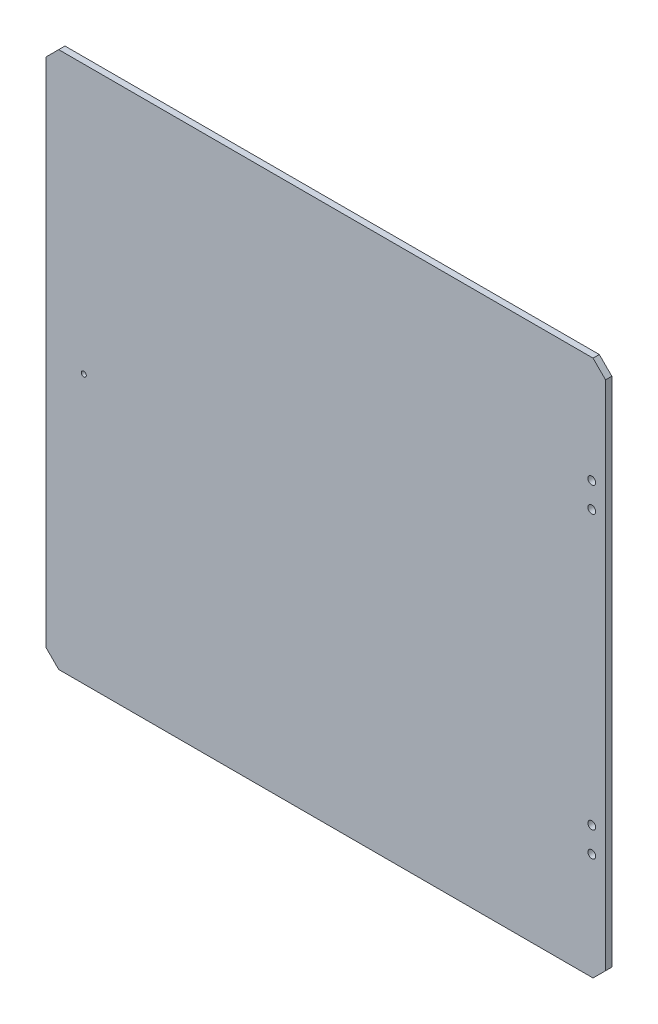
ISO-10303-21;
HEADER;
FILE_DESCRIPTION(('STEP AP214'),'2;1');
FILE_NAME('part.step','',(''),(''),'','','');
FILE_SCHEMA(('AUTOMOTIVE_DESIGN { 1 0 10303 214 1 1 1 1 }'));
ENDSEC;
DATA;
#1=APPLICATION_CONTEXT('core data for automotive mechanical design processes');
#2=APPLICATION_PROTOCOL_DEFINITION('international standard','automotive_design',2000,#1);
#3=PRODUCT_CONTEXT('',#1,'mechanical');
#4=PRODUCT('Part','Part','',(#3));
#5=PRODUCT_RELATED_PRODUCT_CATEGORY('part','',(#4));
#6=PRODUCT_DEFINITION_FORMATION('','',#4);
#7=PRODUCT_DEFINITION_CONTEXT('part definition',#1,'design');
#8=PRODUCT_DEFINITION('design','',#6,#7);
#9=PRODUCT_DEFINITION_SHAPE('','',#8);
#10=(LENGTH_UNIT() NAMED_UNIT(*) SI_UNIT(.MILLI.,.METRE.));
#11=(NAMED_UNIT(*) PLANE_ANGLE_UNIT() SI_UNIT($,.RADIAN.));
#12=(NAMED_UNIT(*) SI_UNIT($,.STERADIAN.) SOLID_ANGLE_UNIT());
#13=UNCERTAINTY_MEASURE_WITH_UNIT(LENGTH_MEASURE(1.E-05),#10,'distance_accuracy_value','');
#14=(GEOMETRIC_REPRESENTATION_CONTEXT(3) GLOBAL_UNCERTAINTY_ASSIGNED_CONTEXT((#13)) GLOBAL_UNIT_ASSIGNED_CONTEXT((#10,
#11,#12)) REPRESENTATION_CONTEXT('',''));
#15=CARTESIAN_POINT('',(0.,0.,0.));
#16=DIRECTION('',(0.,0.,1.));
#17=DIRECTION('',(1.,0.,0.));
#18=AXIS2_PLACEMENT_3D('',#15,#16,#17);
#19=CARTESIAN_POINT('',(0.,0.,5.));
#20=DIRECTION('',(0.,0.,1.));
#21=DIRECTION('',(1.,0.,0.));
#22=AXIS2_PLACEMENT_3D('',#19,#20,#21);
#23=PLANE('',#22);
#24=CARTESIAN_POINT('',(212.,-129.,5.));
#25=DIRECTION('',(0.,0.,1.));
#26=DIRECTION('',(-1.,0.,0.));
#27=AXIS2_PLACEMENT_3D('',#24,#25,#26);
#28=CIRCLE('',#27,3.09999999999999);
#29=CARTESIAN_POINT('',(208.9,-129.,5.));
#30=VERTEX_POINT('',#29);
#31=EDGE_CURVE('E208',#30,#30,#28,.T.);
#32=ORIENTED_EDGE('',*,*,#31,.F.);
#33=EDGE_LOOP('',(#32));
#34=FACE_BOUND('',#33,.T.);
#35=CARTESIAN_POINT('',(212.,109.,5.));
#36=DIRECTION('',(0.,0.,1.));
#37=DIRECTION('',(1.,0.,0.));
#38=AXIS2_PLACEMENT_3D('',#35,#36,#37);
#39=CIRCLE('',#38,3.09999999999999);
#40=CARTESIAN_POINT('',(215.1,109.,5.));
#41=VERTEX_POINT('',#40);
#42=EDGE_CURVE('E198',#41,#41,#39,.T.);
#43=ORIENTED_EDGE('',*,*,#42,.F.);
#44=EDGE_LOOP('',(#43));
#45=FACE_BOUND('',#44,.T.);
#46=DIRECTION('',(0.,-1.,0.));
#47=VECTOR('',#46,1.);
#48=CARTESIAN_POINT('',(-223.,-204.,5.));
#49=LINE('',#48,#47);
#50=CARTESIAN_POINT('',(-223.,204.,5.));
#51=VERTEX_POINT('',#50);
#52=CARTESIAN_POINT('',(-223.,-204.,5.));
#53=VERTEX_POINT('',#52);
#54=EDGE_CURVE('E172',#51,#53,#49,.T.);
#55=ORIENTED_EDGE('',*,*,#54,.T.);
#56=DIRECTION('',(0.707106781186548,-0.707106781186546,0.));
#57=VECTOR('',#56,1.);
#58=CARTESIAN_POINT('',(-213.,-214.,5.));
#59=LINE('',#58,#57);
#60=CARTESIAN_POINT('',(-213.,-214.,5.));
#61=VERTEX_POINT('',#60);
#62=EDGE_CURVE('E108',#53,#61,#59,.T.);
#63=ORIENTED_EDGE('',*,*,#62,.T.);
#64=DIRECTION('',(1.,0.,0.));
#65=VECTOR('',#64,1.);
#66=CARTESIAN_POINT('',(213.,-214.,5.));
#67=LINE('',#66,#65);
#68=CARTESIAN_POINT('',(213.,-214.,5.));
#69=VERTEX_POINT('',#68);
#70=EDGE_CURVE('E167',#61,#69,#67,.T.);
#71=ORIENTED_EDGE('',*,*,#70,.T.);
#72=DIRECTION('',(0.707106781186547,0.707106781186547,0.));
#73=VECTOR('',#72,1.);
#74=CARTESIAN_POINT('',(213.,-214.,5.));
#75=LINE('',#74,#73);
#76=CARTESIAN_POINT('',(223.,-204.,5.));
#77=VERTEX_POINT('',#76);
#78=EDGE_CURVE('E163',#69,#77,#75,.T.);
#79=ORIENTED_EDGE('',*,*,#78,.T.);
#80=DIRECTION('',(0.,1.,0.));
#81=VECTOR('',#80,1.);
#82=CARTESIAN_POINT('',(223.,204.,5.));
#83=LINE('',#82,#81);
#84=CARTESIAN_POINT('',(223.,204.,5.));
#85=VERTEX_POINT('',#84);
#86=EDGE_CURVE('E131',#77,#85,#83,.T.);
#87=ORIENTED_EDGE('',*,*,#86,.T.);
#88=DIRECTION('',(-0.707106781186547,0.707106781186547,0.));
#89=VECTOR('',#88,1.);
#90=CARTESIAN_POINT('',(223.,204.,5.));
#91=LINE('',#90,#89);
#92=CARTESIAN_POINT('',(213.,214.,5.));
#93=VERTEX_POINT('',#92);
#94=EDGE_CURVE('E125',#85,#93,#91,.T.);
#95=ORIENTED_EDGE('',*,*,#94,.T.);
#96=DIRECTION('',(-1.,0.,0.));
#97=VECTOR('',#96,1.);
#98=CARTESIAN_POINT('',(213.,214.,5.));
#99=LINE('',#98,#97);
#100=CARTESIAN_POINT('',(-213.,214.,5.));
#101=VERTEX_POINT('',#100);
#102=EDGE_CURVE('E129',#93,#101,#99,.T.);
#103=ORIENTED_EDGE('',*,*,#102,.T.);
#104=DIRECTION('',(-0.70710678118655,-0.707106781186544,0.));
#105=VECTOR('',#104,1.);
#106=CARTESIAN_POINT('',(-223.,204.,5.));
#107=LINE('',#106,#105);
#108=EDGE_CURVE('E64',#101,#51,#107,.T.);
#109=ORIENTED_EDGE('',*,*,#108,.T.);
#110=EDGE_LOOP('',(#55,#63,#71,#79,#87,#95,#103,#109));
#111=FACE_BOUND('',#110,.T.);
#112=CARTESIAN_POINT('',(212.,129.,5.));
#113=DIRECTION('',(0.,0.,1.));
#114=DIRECTION('',(1.,0.,0.));
#115=AXIS2_PLACEMENT_3D('',#112,#113,#114);
#116=CIRCLE('',#115,3.09999999999999);
#117=CARTESIAN_POINT('',(215.1,129.,5.));
#118=VERTEX_POINT('',#117);
#119=EDGE_CURVE('E194',#118,#118,#116,.T.);
#120=ORIENTED_EDGE('',*,*,#119,.F.);
#121=EDGE_LOOP('',(#120));
#122=FACE_BOUND('',#121,.T.);
#123=CARTESIAN_POINT('',(212.,-109.,5.));
#124=DIRECTION('',(0.,0.,1.));
#125=DIRECTION('',(-1.,0.,0.));
#126=AXIS2_PLACEMENT_3D('',#123,#124,#125);
#127=CIRCLE('',#126,3.09999999999999);
#128=CARTESIAN_POINT('',(208.9,-109.,5.));
#129=VERTEX_POINT('',#128);
#130=EDGE_CURVE('E203',#129,#129,#127,.T.);
#131=ORIENTED_EDGE('',*,*,#130,.F.);
#132=EDGE_LOOP('',(#131));
#133=FACE_BOUND('',#132,.T.);
#134=CARTESIAN_POINT('',(-193.,0.,5.));
#135=DIRECTION('',(0.,0.,1.));
#136=DIRECTION('',(1.,0.,0.));
#137=AXIS2_PLACEMENT_3D('',#134,#135,#136);
#138=CIRCLE('',#137,2.);
#139=CARTESIAN_POINT('',(-191.,0.,5.));
#140=VERTEX_POINT('',#139);
#141=EDGE_CURVE('E213',#140,#140,#138,.T.);
#142=ORIENTED_EDGE('',*,*,#141,.F.);
#143=EDGE_LOOP('',(#142));
#144=FACE_BOUND('',#143,.T.);
#145=ADVANCED_FACE('F43',(#34,#45,#111,#122,#133,#144),#23,.T.);
#146=CARTESIAN_POINT('',(0.,0.,0.));
#147=DIRECTION('',(0.,0.,1.));
#148=DIRECTION('',(1.,0.,0.));
#149=AXIS2_PLACEMENT_3D('',#146,#147,#148);
#150=PLANE('',#149);
#151=DIRECTION('',(0.,-1.,0.));
#152=VECTOR('',#151,1.);
#153=CARTESIAN_POINT('',(-223.,-204.,0.));
#154=LINE('',#153,#152);
#155=CARTESIAN_POINT('',(-223.,204.,0.));
#156=VERTEX_POINT('',#155);
#157=CARTESIAN_POINT('',(-223.,-204.,0.));
#158=VERTEX_POINT('',#157);
#159=EDGE_CURVE('E155',#156,#158,#154,.T.);
#160=ORIENTED_EDGE('',*,*,#159,.F.);
#161=DIRECTION('',(-0.70710678118655,-0.707106781186544,0.));
#162=VECTOR('',#161,1.);
#163=CARTESIAN_POINT('',(-223.,204.,0.));
#164=LINE('',#163,#162);
#165=CARTESIAN_POINT('',(-213.,214.,0.));
#166=VERTEX_POINT('',#165);
#167=EDGE_CURVE('E99',#166,#156,#164,.T.);
#168=ORIENTED_EDGE('',*,*,#167,.F.);
#169=DIRECTION('',(-1.,0.,0.));
#170=VECTOR('',#169,1.);
#171=CARTESIAN_POINT('',(213.,214.,0.));
#172=LINE('',#171,#170);
#173=CARTESIAN_POINT('',(213.,214.,0.));
#174=VERTEX_POINT('',#173);
#175=EDGE_CURVE('E93',#174,#166,#172,.T.);
#176=ORIENTED_EDGE('',*,*,#175,.F.);
#177=DIRECTION('',(-0.707106781186547,0.707106781186547,0.));
#178=VECTOR('',#177,1.);
#179=CARTESIAN_POINT('',(223.,204.,0.));
#180=LINE('',#179,#178);
#181=CARTESIAN_POINT('',(223.,204.,0.));
#182=VERTEX_POINT('',#181);
#183=EDGE_CURVE('E140',#182,#174,#180,.T.);
#184=ORIENTED_EDGE('',*,*,#183,.F.);
#185=DIRECTION('',(0.,1.,0.));
#186=VECTOR('',#185,1.);
#187=CARTESIAN_POINT('',(223.,204.,0.));
#188=LINE('',#187,#186);
#189=CARTESIAN_POINT('',(223.,-204.,0.));
#190=VERTEX_POINT('',#189);
#191=EDGE_CURVE('E180',#190,#182,#188,.T.);
#192=ORIENTED_EDGE('',*,*,#191,.F.);
#193=DIRECTION('',(0.707106781186547,0.707106781186547,0.));
#194=VECTOR('',#193,1.);
#195=CARTESIAN_POINT('',(213.,-214.,0.));
#196=LINE('',#195,#194);
#197=CARTESIAN_POINT('',(213.,-214.,0.));
#198=VERTEX_POINT('',#197);
#199=EDGE_CURVE('E183',#198,#190,#196,.T.);
#200=ORIENTED_EDGE('',*,*,#199,.F.);
#201=DIRECTION('',(1.,0.,0.));
#202=VECTOR('',#201,1.);
#203=CARTESIAN_POINT('',(213.,-214.,0.));
#204=LINE('',#203,#202);
#205=CARTESIAN_POINT('',(-213.,-214.,0.));
#206=VERTEX_POINT('',#205);
#207=EDGE_CURVE('E186',#206,#198,#204,.T.);
#208=ORIENTED_EDGE('',*,*,#207,.F.);
#209=DIRECTION('',(0.707106781186548,-0.707106781186546,0.));
#210=VECTOR('',#209,1.);
#211=CARTESIAN_POINT('',(-213.,-214.,0.));
#212=LINE('',#211,#210);
#213=EDGE_CURVE('E189',#158,#206,#212,.T.);
#214=ORIENTED_EDGE('',*,*,#213,.F.);
#215=EDGE_LOOP('',(#160,#168,#176,#184,#192,#200,#208,#214));
#216=FACE_BOUND('',#215,.T.);
#217=CARTESIAN_POINT('',(212.,129.,0.));
#218=DIRECTION('',(0.,0.,1.));
#219=DIRECTION('',(1.,0.,0.));
#220=AXIS2_PLACEMENT_3D('',#217,#218,#219);
#221=CIRCLE('',#220,3.09999999999999);
#222=CARTESIAN_POINT('',(215.1,129.,0.));
#223=VERTEX_POINT('',#222);
#224=EDGE_CURVE('E195',#223,#223,#221,.T.);
#225=ORIENTED_EDGE('',*,*,#224,.T.);
#226=EDGE_LOOP('',(#225));
#227=FACE_BOUND('',#226,.T.);
#228=CARTESIAN_POINT('',(212.,109.,0.));
#229=DIRECTION('',(0.,0.,1.));
#230=DIRECTION('',(1.,0.,0.));
#231=AXIS2_PLACEMENT_3D('',#228,#229,#230);
#232=CIRCLE('',#231,3.09999999999999);
#233=CARTESIAN_POINT('',(215.1,109.,0.));
#234=VERTEX_POINT('',#233);
#235=EDGE_CURVE('E200',#234,#234,#232,.T.);
#236=ORIENTED_EDGE('',*,*,#235,.T.);
#237=EDGE_LOOP('',(#236));
#238=FACE_BOUND('',#237,.T.);
#239=CARTESIAN_POINT('',(212.,-109.,0.));
#240=DIRECTION('',(0.,0.,1.));
#241=DIRECTION('',(-1.,0.,0.));
#242=AXIS2_PLACEMENT_3D('',#239,#240,#241);
#243=CIRCLE('',#242,3.09999999999999);
#244=CARTESIAN_POINT('',(208.9,-109.,0.));
#245=VERTEX_POINT('',#244);
#246=EDGE_CURVE('E205',#245,#245,#243,.T.);
#247=ORIENTED_EDGE('',*,*,#246,.T.);
#248=EDGE_LOOP('',(#247));
#249=FACE_BOUND('',#248,.T.);
#250=CARTESIAN_POINT('',(212.,-129.,0.));
#251=DIRECTION('',(0.,0.,1.));
#252=DIRECTION('',(-1.,0.,0.));
#253=AXIS2_PLACEMENT_3D('',#250,#251,#252);
#254=CIRCLE('',#253,3.09999999999999);
#255=CARTESIAN_POINT('',(208.9,-129.,0.));
#256=VERTEX_POINT('',#255);
#257=EDGE_CURVE('E210',#256,#256,#254,.T.);
#258=ORIENTED_EDGE('',*,*,#257,.T.);
#259=EDGE_LOOP('',(#258));
#260=FACE_BOUND('',#259,.T.);
#261=CARTESIAN_POINT('',(-193.,0.,0.));
#262=DIRECTION('',(0.,0.,1.));
#263=DIRECTION('',(1.,0.,0.));
#264=AXIS2_PLACEMENT_3D('',#261,#262,#263);
#265=CIRCLE('',#264,2.);
#266=CARTESIAN_POINT('',(-191.,0.,0.));
#267=VERTEX_POINT('',#266);
#268=EDGE_CURVE('E215',#267,#267,#265,.T.);
#269=ORIENTED_EDGE('',*,*,#268,.T.);
#270=EDGE_LOOP('',(#269));
#271=FACE_BOUND('',#270,.T.);
#272=ADVANCED_FACE('F257',(#216,#227,#238,#249,#260,#271),#150,.F.);
#273=CARTESIAN_POINT('',(-223.,-204.,5.));
#274=DIRECTION('',(1.,0.,0.));
#275=DIRECTION('',(0.,1.,0.));
#276=AXIS2_PLACEMENT_3D('',#273,#274,#275);
#277=PLANE('',#276);
#278=ORIENTED_EDGE('',*,*,#159,.T.);
#279=DIRECTION('',(0.,0.,-1.));
#280=VECTOR('',#279,1.);
#281=CARTESIAN_POINT('',(-223.,-204.,5.));
#282=LINE('',#281,#280);
#283=EDGE_CURVE('E12',#53,#158,#282,.T.);
#284=ORIENTED_EDGE('',*,*,#283,.F.);
#285=ORIENTED_EDGE('',*,*,#54,.F.);
#286=DIRECTION('',(0.,0.,-1.));
#287=VECTOR('',#286,1.);
#288=CARTESIAN_POINT('',(-223.,204.,5.));
#289=LINE('',#288,#287);
#290=EDGE_CURVE('E149',#51,#156,#289,.T.);
#291=ORIENTED_EDGE('',*,*,#290,.T.);
#292=EDGE_LOOP('',(#278,#284,#285,#291));
#293=FACE_BOUND('',#292,.T.);
#294=ADVANCED_FACE('F45',(#293),#277,.F.);
#295=CARTESIAN_POINT('',(-213.,-214.,5.));
#296=DIRECTION('',(0.707106781186546,0.707106781186548,0.));
#297=DIRECTION('',(-0.707106781186549,0.707106781186547,0.));
#298=AXIS2_PLACEMENT_3D('',#295,#296,#297);
#299=PLANE('',#298);
#300=ORIENTED_EDGE('',*,*,#213,.T.);
#301=DIRECTION('',(0.,0.,-1.));
#302=VECTOR('',#301,1.);
#303=CARTESIAN_POINT('',(-213.,-214.,5.));
#304=LINE('',#303,#302);
#305=EDGE_CURVE('E53',#61,#206,#304,.T.);
#306=ORIENTED_EDGE('',*,*,#305,.F.);
#307=ORIENTED_EDGE('',*,*,#62,.F.);
#308=ORIENTED_EDGE('',*,*,#283,.T.);
#309=EDGE_LOOP('',(#300,#306,#307,#308));
#310=FACE_BOUND('',#309,.T.);
#311=ADVANCED_FACE('F305',(#310),#299,.F.);
#312=CARTESIAN_POINT('',(213.,-214.,5.));
#313=DIRECTION('',(0.,1.,0.));
#314=DIRECTION('',(-1.,0.,0.));
#315=AXIS2_PLACEMENT_3D('',#312,#313,#314);
#316=PLANE('',#315);
#317=ORIENTED_EDGE('',*,*,#207,.T.);
#318=DIRECTION('',(0.,0.,-1.));
#319=VECTOR('',#318,1.);
#320=CARTESIAN_POINT('',(213.,-214.,5.));
#321=LINE('',#320,#319);
#322=EDGE_CURVE('E320',#69,#198,#321,.T.);
#323=ORIENTED_EDGE('',*,*,#322,.F.);
#324=ORIENTED_EDGE('',*,*,#70,.F.);
#325=ORIENTED_EDGE('',*,*,#305,.T.);
#326=EDGE_LOOP('',(#317,#323,#324,#325));
#327=FACE_BOUND('',#326,.T.);
#328=ADVANCED_FACE('F302',(#327),#316,.F.);
#329=CARTESIAN_POINT('',(213.,-214.,5.));
#330=DIRECTION('',(-0.707106781186548,0.707106781186548,0.));
#331=DIRECTION('',(-0.707106781186548,-0.707106781186548,0.));
#332=AXIS2_PLACEMENT_3D('',#329,#330,#331);
#333=PLANE('',#332);
#334=ORIENTED_EDGE('',*,*,#199,.T.);
#335=DIRECTION('',(0.,0.,-1.));
#336=VECTOR('',#335,1.);
#337=CARTESIAN_POINT('',(223.,-204.,5.));
#338=LINE('',#337,#336);
#339=EDGE_CURVE('E327',#77,#190,#338,.T.);
#340=ORIENTED_EDGE('',*,*,#339,.F.);
#341=ORIENTED_EDGE('',*,*,#78,.F.);
#342=ORIENTED_EDGE('',*,*,#322,.T.);
#343=EDGE_LOOP('',(#334,#340,#341,#342));
#344=FACE_BOUND('',#343,.T.);
#345=ADVANCED_FACE('F298',(#344),#333,.F.);
#346=CARTESIAN_POINT('',(223.,204.,5.));
#347=DIRECTION('',(-1.,0.,0.));
#348=DIRECTION('',(0.,0.,1.));
#349=AXIS2_PLACEMENT_3D('',#346,#347,#348);
#350=PLANE('',#349);
#351=ORIENTED_EDGE('',*,*,#191,.T.);
#352=DIRECTION('',(0.,0.,-1.));
#353=VECTOR('',#352,1.);
#354=CARTESIAN_POINT('',(223.,204.,5.));
#355=LINE('',#354,#353);
#356=EDGE_CURVE('E142',#85,#182,#355,.T.);
#357=ORIENTED_EDGE('',*,*,#356,.F.);
#358=ORIENTED_EDGE('',*,*,#86,.F.);
#359=ORIENTED_EDGE('',*,*,#339,.T.);
#360=EDGE_LOOP('',(#351,#357,#358,#359));
#361=FACE_BOUND('',#360,.T.);
#362=ADVANCED_FACE('F295',(#361),#350,.F.);
#363=CARTESIAN_POINT('',(223.,204.,5.));
#364=DIRECTION('',(-0.707106781186548,-0.707106781186548,0.));
#365=DIRECTION('',(0.707106781186548,-0.707106781186548,0.));
#366=AXIS2_PLACEMENT_3D('',#363,#364,#365);
#367=PLANE('',#366);
#368=ORIENTED_EDGE('',*,*,#183,.T.);
#369=DIRECTION('',(0.,0.,-1.));
#370=VECTOR('',#369,1.);
#371=CARTESIAN_POINT('',(213.,214.,5.));
#372=LINE('',#371,#370);
#373=EDGE_CURVE('E137',#93,#174,#372,.T.);
#374=ORIENTED_EDGE('',*,*,#373,.F.);
#375=ORIENTED_EDGE('',*,*,#94,.F.);
#376=ORIENTED_EDGE('',*,*,#356,.T.);
#377=EDGE_LOOP('',(#368,#374,#375,#376));
#378=FACE_BOUND('',#377,.T.);
#379=ADVANCED_FACE('F138',(#378),#367,.F.);
#380=CARTESIAN_POINT('',(213.,214.,5.));
#381=DIRECTION('',(0.,-1.,0.));
#382=DIRECTION('',(1.,0.,0.));
#383=AXIS2_PLACEMENT_3D('',#380,#381,#382);
#384=PLANE('',#383);
#385=ORIENTED_EDGE('',*,*,#175,.T.);
#386=DIRECTION('',(0.,0.,-1.));
#387=VECTOR('',#386,1.);
#388=CARTESIAN_POINT('',(-213.,214.,5.));
#389=LINE('',#388,#387);
#390=EDGE_CURVE('E143',#101,#166,#389,.T.);
#391=ORIENTED_EDGE('',*,*,#390,.F.);
#392=ORIENTED_EDGE('',*,*,#102,.F.);
#393=ORIENTED_EDGE('',*,*,#373,.T.);
#394=EDGE_LOOP('',(#385,#391,#392,#393));
#395=FACE_BOUND('',#394,.T.);
#396=ADVANCED_FACE('F145',(#395),#384,.F.);
#397=CARTESIAN_POINT('',(-223.,204.,5.));
#398=DIRECTION('',(0.707106781186544,-0.70710678118655,0.));
#399=DIRECTION('',(0.70710678118655,0.707106781186545,0.));
#400=AXIS2_PLACEMENT_3D('',#397,#398,#399);
#401=PLANE('',#400);
#402=ORIENTED_EDGE('',*,*,#167,.T.);
#403=ORIENTED_EDGE('',*,*,#290,.F.);
#404=ORIENTED_EDGE('',*,*,#108,.F.);
#405=ORIENTED_EDGE('',*,*,#390,.T.);
#406=EDGE_LOOP('',(#402,#403,#404,#405));
#407=FACE_BOUND('',#406,.T.);
#408=ADVANCED_FACE('F284',(#407),#401,.F.);
#409=CARTESIAN_POINT('',(212.,129.,5.));
#410=DIRECTION('',(0.,0.,-1.));
#411=DIRECTION('',(-1.,0.,0.));
#412=AXIS2_PLACEMENT_3D('',#409,#410,#411);
#413=CYLINDRICAL_SURFACE('',#412,3.09999999999999);
#414=ORIENTED_EDGE('',*,*,#119,.T.);
#415=EDGE_LOOP('',(#414));
#416=FACE_BOUND('',#415,.T.);
#417=ORIENTED_EDGE('',*,*,#224,.F.);
#418=EDGE_LOOP('',(#417));
#419=FACE_BOUND('',#418,.T.);
#420=ADVANCED_FACE('F253',(#416,#419),#413,.F.);
#421=CARTESIAN_POINT('',(212.,109.,5.));
#422=DIRECTION('',(0.,0.,-1.));
#423=DIRECTION('',(-1.,0.,0.));
#424=AXIS2_PLACEMENT_3D('',#421,#422,#423);
#425=CYLINDRICAL_SURFACE('',#424,3.09999999999999);
#426=ORIENTED_EDGE('',*,*,#42,.T.);
#427=EDGE_LOOP('',(#426));
#428=FACE_BOUND('',#427,.T.);
#429=ORIENTED_EDGE('',*,*,#235,.F.);
#430=EDGE_LOOP('',(#429));
#431=FACE_BOUND('',#430,.T.);
#432=ADVANCED_FACE('F278',(#428,#431),#425,.F.);
#433=CARTESIAN_POINT('',(212.,-109.,5.));
#434=DIRECTION('',(0.,0.,-1.));
#435=DIRECTION('',(-1.,0.,0.));
#436=AXIS2_PLACEMENT_3D('',#433,#434,#435);
#437=CYLINDRICAL_SURFACE('',#436,3.09999999999999);
#438=ORIENTED_EDGE('',*,*,#130,.T.);
#439=EDGE_LOOP('',(#438));
#440=FACE_BOUND('',#439,.T.);
#441=ORIENTED_EDGE('',*,*,#246,.F.);
#442=EDGE_LOOP('',(#441));
#443=FACE_BOUND('',#442,.T.);
#444=ADVANCED_FACE('F272',(#440,#443),#437,.F.);
#445=CARTESIAN_POINT('',(212.,-129.,5.));
#446=DIRECTION('',(0.,0.,-1.));
#447=DIRECTION('',(-1.,0.,0.));
#448=AXIS2_PLACEMENT_3D('',#445,#446,#447);
#449=CYLINDRICAL_SURFACE('',#448,3.09999999999999);
#450=ORIENTED_EDGE('',*,*,#31,.T.);
#451=EDGE_LOOP('',(#450));
#452=FACE_BOUND('',#451,.T.);
#453=ORIENTED_EDGE('',*,*,#257,.F.);
#454=EDGE_LOOP('',(#453));
#455=FACE_BOUND('',#454,.T.);
#456=ADVANCED_FACE('F267',(#452,#455),#449,.F.);
#457=CARTESIAN_POINT('',(-193.,0.,5.));
#458=DIRECTION('',(0.,0.,-1.));
#459=DIRECTION('',(-1.,0.,0.));
#460=AXIS2_PLACEMENT_3D('',#457,#458,#459);
#461=CYLINDRICAL_SURFACE('',#460,2.);
#462=ORIENTED_EDGE('',*,*,#141,.T.);
#463=EDGE_LOOP('',(#462));
#464=FACE_BOUND('',#463,.T.);
#465=ORIENTED_EDGE('',*,*,#268,.F.);
#466=EDGE_LOOP('',(#465));
#467=FACE_BOUND('',#466,.T.);
#468=ADVANCED_FACE('F264',(#464,#467),#461,.F.);
#469=CLOSED_SHELL('',(#145,#272,#294,#311,#328,#345,#362,#379,#396,#408,#420,#432,#444,#456,#468));
#470=MANIFOLD_SOLID_BREP('B2',#469);
#471=ADVANCED_BREP_SHAPE_REPRESENTATION('',(#18,#470),#14);
#472=SHAPE_DEFINITION_REPRESENTATION(#9,#471);
ENDSEC;
END-ISO-10303-21;
